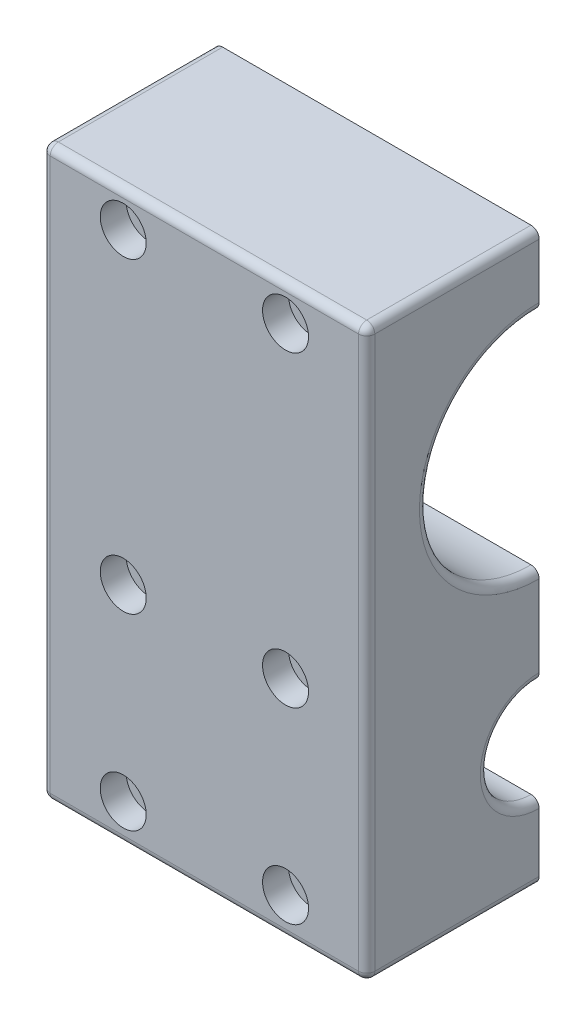
ISO-10303-21;
HEADER;
FILE_DESCRIPTION(('STEP AP214'),'2;1');
FILE_NAME('part.step','',(''),(''),'','','');
FILE_SCHEMA(('AUTOMOTIVE_DESIGN { 1 0 10303 214 1 1 1 1 }'));
ENDSEC;
DATA;
#1=APPLICATION_CONTEXT('core data for automotive mechanical design processes');
#2=APPLICATION_PROTOCOL_DEFINITION('international standard','automotive_design',2000,#1);
#3=PRODUCT_CONTEXT('',#1,'mechanical');
#4=PRODUCT('Part','Part','',(#3));
#5=PRODUCT_RELATED_PRODUCT_CATEGORY('part','',(#4));
#6=PRODUCT_DEFINITION_FORMATION('','',#4);
#7=PRODUCT_DEFINITION_CONTEXT('part definition',#1,'design');
#8=PRODUCT_DEFINITION('design','',#6,#7);
#9=PRODUCT_DEFINITION_SHAPE('','',#8);
#10=(LENGTH_UNIT() NAMED_UNIT(*) SI_UNIT(.MILLI.,.METRE.));
#11=(NAMED_UNIT(*) PLANE_ANGLE_UNIT() SI_UNIT($,.RADIAN.));
#12=(NAMED_UNIT(*) SI_UNIT($,.STERADIAN.) SOLID_ANGLE_UNIT());
#13=UNCERTAINTY_MEASURE_WITH_UNIT(LENGTH_MEASURE(1.E-05),#10,'distance_accuracy_value','');
#14=(GEOMETRIC_REPRESENTATION_CONTEXT(3) GLOBAL_UNCERTAINTY_ASSIGNED_CONTEXT((#13)) GLOBAL_UNIT_ASSIGNED_CONTEXT((#10,
#11,#12)) REPRESENTATION_CONTEXT('',''));
#15=CARTESIAN_POINT('',(0.,0.,0.));
#16=DIRECTION('',(0.,0.,1.));
#17=DIRECTION('',(1.,0.,0.));
#18=AXIS2_PLACEMENT_3D('',#15,#16,#17);
#19=CARTESIAN_POINT('',(0.,0.,-26.9875));
#20=DIRECTION('',(0.,0.,1.));
#21=DIRECTION('',(1.,0.,0.));
#22=AXIS2_PLACEMENT_3D('',#19,#20,#21);
#23=PLANE('',#22);
#24=DIRECTION('',(1.,0.,0.));
#25=VECTOR('',#24,1.);
#26=CARTESIAN_POINT('',(50.8,88.9,-26.9875));
#27=LINE('',#26,#25);
#28=CARTESIAN_POINT('',(1.27,88.9,-26.9875));
#29=VERTEX_POINT('',#28);
#30=CARTESIAN_POINT('',(49.53,88.9,-26.9875));
#31=VERTEX_POINT('',#30);
#32=EDGE_CURVE('E493',#29,#31,#27,.T.);
#33=ORIENTED_EDGE('',*,*,#32,.T.);
#34=CARTESIAN_POINT('',(49.53,87.63,-26.9875));
#35=DIRECTION('',(0.,0.,1.));
#36=DIRECTION('',(1.,0.,0.));
#37=AXIS2_PLACEMENT_3D('',#34,#35,#36);
#38=CIRCLE('',#37,1.27);
#39=CARTESIAN_POINT('',(50.8,87.63,-26.9875));
#40=VERTEX_POINT('',#39);
#41=EDGE_CURVE('E93',#31,#40,#38,.F.);
#42=ORIENTED_EDGE('',*,*,#41,.T.);
#43=DIRECTION('',(0.,-1.,0.));
#44=VECTOR('',#43,1.);
#45=CARTESIAN_POINT('',(50.8,0.,-26.9875));
#46=LINE('',#45,#44);
#47=CARTESIAN_POINT('',(50.8,79.0575,-26.9875));
#48=VERTEX_POINT('',#47);
#49=EDGE_CURVE('E86',#40,#48,#46,.T.);
#50=ORIENTED_EDGE('',*,*,#49,.T.);
#51=CARTESIAN_POINT('',(49.53,79.0575,-26.9875));
#52=DIRECTION('',(0.,0.,1.));
#53=DIRECTION('',(1.,0.,0.));
#54=AXIS2_PLACEMENT_3D('',#51,#52,#53);
#55=CIRCLE('',#54,1.27);
#56=CARTESIAN_POINT('',(49.53,77.7875,-26.9875));
#57=VERTEX_POINT('',#56);
#58=EDGE_CURVE('E216',#48,#57,#55,.F.);
#59=ORIENTED_EDGE('',*,*,#58,.T.);
#60=DIRECTION('',(-1.,0.,0.));
#61=VECTOR('',#60,1.);
#62=CARTESIAN_POINT('',(50.8,77.7875,-26.9875));
#63=LINE('',#62,#61);
#64=CARTESIAN_POINT('',(1.27,77.7875,-26.9875));
#65=VERTEX_POINT('',#64);
#66=EDGE_CURVE('E217',#57,#65,#63,.T.);
#67=ORIENTED_EDGE('',*,*,#66,.T.);
#68=CARTESIAN_POINT('',(1.27,79.0575,-26.9875));
#69=DIRECTION('',(0.,0.,1.));
#70=DIRECTION('',(1.,0.,0.));
#71=AXIS2_PLACEMENT_3D('',#68,#69,#70);
#72=CIRCLE('',#71,1.27);
#73=CARTESIAN_POINT('',(0.,79.0575,-26.9875));
#74=VERTEX_POINT('',#73);
#75=EDGE_CURVE('E79',#65,#74,#72,.F.);
#76=ORIENTED_EDGE('',*,*,#75,.T.);
#77=DIRECTION('',(0.,-1.,0.));
#78=VECTOR('',#77,1.);
#79=CARTESIAN_POINT('',(0.,0.,-26.9875));
#80=LINE('',#79,#78);
#81=CARTESIAN_POINT('',(0.,87.63,-26.9875));
#82=VERTEX_POINT('',#81);
#83=EDGE_CURVE('E209',#82,#74,#80,.T.);
#84=ORIENTED_EDGE('',*,*,#83,.F.);
#85=CARTESIAN_POINT('',(1.27,87.63,-26.9875));
#86=DIRECTION('',(0.,0.,1.));
#87=DIRECTION('',(1.,0.,0.));
#88=AXIS2_PLACEMENT_3D('',#85,#86,#87);
#89=CIRCLE('',#88,1.27);
#90=EDGE_CURVE('E496',#82,#29,#89,.F.);
#91=ORIENTED_EDGE('',*,*,#90,.T.);
#92=EDGE_LOOP('',(#33,#42,#50,#59,#67,#76,#84,#91));
#93=FACE_BOUND('',#92,.T.);
#94=CARTESIAN_POINT('',(38.1,83.34375,-26.9875));
#95=DIRECTION('',(0.,0.,1.));
#96=DIRECTION('',(1.,0.,0.));
#97=AXIS2_PLACEMENT_3D('',#94,#95,#96);
#98=CIRCLE('',#97,2.09);
#99=CARTESIAN_POINT('',(40.19,83.34375,-26.9875));
#100=VERTEX_POINT('',#99);
#101=EDGE_CURVE('E432',#100,#100,#98,.F.);
#102=ORIENTED_EDGE('',*,*,#101,.F.);
#103=EDGE_LOOP('',(#102));
#104=FACE_BOUND('',#103,.T.);
#105=CARTESIAN_POINT('',(12.7,83.34375,-26.9875));
#106=DIRECTION('',(0.,0.,1.));
#107=DIRECTION('',(1.,0.,0.));
#108=AXIS2_PLACEMENT_3D('',#105,#106,#107);
#109=CIRCLE('',#108,2.09);
#110=CARTESIAN_POINT('',(14.79,83.34375,-26.9875));
#111=VERTEX_POINT('',#110);
#112=EDGE_CURVE('E277',#111,#111,#109,.F.);
#113=ORIENTED_EDGE('',*,*,#112,.F.);
#114=EDGE_LOOP('',(#113));
#115=FACE_BOUND('',#114,.T.);
#116=ADVANCED_FACE('F70',(#93,#104,#115),#23,.F.);
#117=CARTESIAN_POINT('',(12.7,83.34375,-53.975));
#118=DIRECTION('',(0.,0.,1.));
#119=DIRECTION('',(1.,0.,0.));
#120=AXIS2_PLACEMENT_3D('',#117,#118,#119);
#121=CYLINDRICAL_SURFACE('',#120,2.09);
#122=ORIENTED_EDGE('',*,*,#112,.T.);
#123=EDGE_LOOP('',(#122));
#124=FACE_BOUND('',#123,.T.);
#125=CARTESIAN_POINT('',(12.7,83.34375,-4.064));
#126=DIRECTION('',(0.,0.,1.));
#127=DIRECTION('',(1.,0.,0.));
#128=AXIS2_PLACEMENT_3D('',#125,#126,#127);
#129=CIRCLE('',#128,2.09);
#130=CARTESIAN_POINT('',(14.79,83.34375,-4.064));
#131=VERTEX_POINT('',#130);
#132=EDGE_CURVE('E350',#131,#131,#129,.F.);
#133=ORIENTED_EDGE('',*,*,#132,.F.);
#134=EDGE_LOOP('',(#133));
#135=FACE_BOUND('',#134,.T.);
#136=ADVANCED_FACE('F617',(#124,#135),#121,.F.);
#137=CARTESIAN_POINT('',(38.1,5.87374999999999,-53.975));
#138=DIRECTION('',(0.,0.,1.));
#139=DIRECTION('',(1.,0.,0.));
#140=AXIS2_PLACEMENT_3D('',#137,#138,#139);
#141=CYLINDRICAL_SURFACE('',#140,2.09);
#142=CARTESIAN_POINT('',(38.1,5.87374999999999,-26.9875));
#143=DIRECTION('',(0.,0.,1.));
#144=DIRECTION('',(1.,0.,0.));
#145=AXIS2_PLACEMENT_3D('',#142,#143,#144);
#146=CIRCLE('',#145,2.09);
#147=CARTESIAN_POINT('',(40.19,5.87374999999999,-26.9875));
#148=VERTEX_POINT('',#147);
#149=EDGE_CURVE('E424',#148,#148,#146,.F.);
#150=ORIENTED_EDGE('',*,*,#149,.T.);
#151=EDGE_LOOP('',(#150));
#152=FACE_BOUND('',#151,.T.);
#153=CARTESIAN_POINT('',(38.1,5.87374999999999,-4.064));
#154=DIRECTION('',(0.,0.,1.));
#155=DIRECTION('',(1.,0.,0.));
#156=AXIS2_PLACEMENT_3D('',#153,#154,#155);
#157=CIRCLE('',#156,2.09);
#158=CARTESIAN_POINT('',(40.19,5.87374999999999,-4.064));
#159=VERTEX_POINT('',#158);
#160=EDGE_CURVE('E354',#159,#159,#157,.F.);
#161=ORIENTED_EDGE('',*,*,#160,.F.);
#162=EDGE_LOOP('',(#161));
#163=FACE_BOUND('',#162,.T.);
#164=ADVANCED_FACE('F622',(#152,#163),#141,.F.);
#165=CARTESIAN_POINT('',(12.7,35.2425,-53.975));
#166=DIRECTION('',(0.,0.,1.));
#167=DIRECTION('',(1.,0.,0.));
#168=AXIS2_PLACEMENT_3D('',#165,#166,#167);
#169=CYLINDRICAL_SURFACE('',#168,2.09);
#170=CARTESIAN_POINT('',(12.7,35.2425,-26.9875));
#171=DIRECTION('',(0.,0.,1.));
#172=DIRECTION('',(1.,0.,0.));
#173=AXIS2_PLACEMENT_3D('',#170,#171,#172);
#174=CIRCLE('',#173,2.09);
#175=CARTESIAN_POINT('',(14.79,35.2425,-26.9875));
#176=VERTEX_POINT('',#175);
#177=EDGE_CURVE('E428',#176,#176,#174,.F.);
#178=ORIENTED_EDGE('',*,*,#177,.T.);
#179=EDGE_LOOP('',(#178));
#180=FACE_BOUND('',#179,.T.);
#181=CARTESIAN_POINT('',(12.7,35.2425,-4.064));
#182=DIRECTION('',(0.,0.,1.));
#183=DIRECTION('',(1.,0.,0.));
#184=AXIS2_PLACEMENT_3D('',#181,#182,#183);
#185=CIRCLE('',#184,2.09);
#186=CARTESIAN_POINT('',(14.79,35.2425,-4.064));
#187=VERTEX_POINT('',#186);
#188=EDGE_CURVE('E358',#187,#187,#185,.F.);
#189=ORIENTED_EDGE('',*,*,#188,.F.);
#190=EDGE_LOOP('',(#189));
#191=FACE_BOUND('',#190,.T.);
#192=ADVANCED_FACE('F683',(#180,#191),#169,.F.);
#193=CARTESIAN_POINT('',(38.1,83.34375,-53.975));
#194=DIRECTION('',(0.,0.,1.));
#195=DIRECTION('',(1.,0.,0.));
#196=AXIS2_PLACEMENT_3D('',#193,#194,#195);
#197=CYLINDRICAL_SURFACE('',#196,2.09);
#198=ORIENTED_EDGE('',*,*,#101,.T.);
#199=EDGE_LOOP('',(#198));
#200=FACE_BOUND('',#199,.T.);
#201=CARTESIAN_POINT('',(38.1,83.34375,-4.064));
#202=DIRECTION('',(0.,0.,1.));
#203=DIRECTION('',(1.,0.,0.));
#204=AXIS2_PLACEMENT_3D('',#201,#202,#203);
#205=CIRCLE('',#204,2.09);
#206=CARTESIAN_POINT('',(40.19,83.34375,-4.064));
#207=VERTEX_POINT('',#206);
#208=EDGE_CURVE('E362',#207,#207,#205,.F.);
#209=ORIENTED_EDGE('',*,*,#208,.F.);
#210=EDGE_LOOP('',(#209));
#211=FACE_BOUND('',#210,.T.);
#212=ADVANCED_FACE('F679',(#200,#211),#197,.F.);
#213=CARTESIAN_POINT('',(38.1,35.2425,-53.975));
#214=DIRECTION('',(0.,0.,1.));
#215=DIRECTION('',(1.,0.,0.));
#216=AXIS2_PLACEMENT_3D('',#213,#214,#215);
#217=CYLINDRICAL_SURFACE('',#216,2.09);
#218=CARTESIAN_POINT('',(38.1,35.2425,-26.9875));
#219=DIRECTION('',(0.,0.,1.));
#220=DIRECTION('',(1.,0.,0.));
#221=AXIS2_PLACEMENT_3D('',#218,#219,#220);
#222=CIRCLE('',#221,2.09);
#223=CARTESIAN_POINT('',(40.19,35.2425,-26.9875));
#224=VERTEX_POINT('',#223);
#225=EDGE_CURVE('E436',#224,#224,#222,.F.);
#226=ORIENTED_EDGE('',*,*,#225,.T.);
#227=EDGE_LOOP('',(#226));
#228=FACE_BOUND('',#227,.T.);
#229=CARTESIAN_POINT('',(38.1,35.2425,-4.064));
#230=DIRECTION('',(0.,0.,1.));
#231=DIRECTION('',(1.,0.,0.));
#232=AXIS2_PLACEMENT_3D('',#229,#230,#231);
#233=CIRCLE('',#232,2.09);
#234=CARTESIAN_POINT('',(40.19,35.2425,-4.064));
#235=VERTEX_POINT('',#234);
#236=EDGE_CURVE('E366',#235,#235,#233,.F.);
#237=ORIENTED_EDGE('',*,*,#236,.F.);
#238=EDGE_LOOP('',(#237));
#239=FACE_BOUND('',#238,.T.);
#240=ADVANCED_FACE('F682',(#228,#239),#217,.F.);
#241=CARTESIAN_POINT('',(12.7,5.87374999999999,-53.975));
#242=DIRECTION('',(0.,0.,1.));
#243=DIRECTION('',(1.,0.,0.));
#244=AXIS2_PLACEMENT_3D('',#241,#242,#243);
#245=CYLINDRICAL_SURFACE('',#244,2.09);
#246=CARTESIAN_POINT('',(12.7,5.87374999999999,-26.9875));
#247=DIRECTION('',(0.,0.,1.));
#248=DIRECTION('',(1.,0.,0.));
#249=AXIS2_PLACEMENT_3D('',#246,#247,#248);
#250=CIRCLE('',#249,2.09);
#251=CARTESIAN_POINT('',(14.79,5.87374999999999,-26.9875));
#252=VERTEX_POINT('',#251);
#253=EDGE_CURVE('E440',#252,#252,#250,.F.);
#254=ORIENTED_EDGE('',*,*,#253,.T.);
#255=EDGE_LOOP('',(#254));
#256=FACE_BOUND('',#255,.T.);
#257=CARTESIAN_POINT('',(12.7,5.87374999999999,-4.064));
#258=DIRECTION('',(0.,0.,1.));
#259=DIRECTION('',(1.,0.,0.));
#260=AXIS2_PLACEMENT_3D('',#257,#258,#259);
#261=CIRCLE('',#260,2.09);
#262=CARTESIAN_POINT('',(14.79,5.87374999999999,-4.064));
#263=VERTEX_POINT('',#262);
#264=EDGE_CURVE('E370',#263,#263,#261,.F.);
#265=ORIENTED_EDGE('',*,*,#264,.F.);
#266=EDGE_LOOP('',(#265));
#267=FACE_BOUND('',#266,.T.);
#268=ADVANCED_FACE('F673',(#256,#267),#245,.F.);
#269=CARTESIAN_POINT('',(50.8,0.,0.));
#270=DIRECTION('',(1.,0.,0.));
#271=DIRECTION('',(0.,0.,-1.));
#272=AXIS2_PLACEMENT_3D('',#269,#270,#271);
#273=PLANE('',#272);
#274=ORIENTED_EDGE('',*,*,#49,.F.);
#275=DIRECTION('',(0.,0.,-1.));
#276=VECTOR('',#275,1.);
#277=CARTESIAN_POINT('',(50.8,87.63,0.));
#278=LINE('',#277,#276);
#279=CARTESIAN_POINT('',(50.8,87.63,-1.26999999999999));
#280=VERTEX_POINT('',#279);
#281=EDGE_CURVE('E305',#40,#280,#278,.F.);
#282=ORIENTED_EDGE('',*,*,#281,.T.);
#283=DIRECTION('',(0.,1.,0.));
#284=VECTOR('',#283,1.);
#285=CARTESIAN_POINT('',(50.8,0.,-1.27));
#286=LINE('',#285,#284);
#287=CARTESIAN_POINT('',(50.8,1.27,-1.27));
#288=VERTEX_POINT('',#287);
#289=EDGE_CURVE('E302',#280,#288,#286,.F.);
#290=ORIENTED_EDGE('',*,*,#289,.T.);
#291=DIRECTION('',(0.,0.,-1.));
#292=VECTOR('',#291,1.);
#293=CARTESIAN_POINT('',(50.8,1.27,-53.975));
#294=LINE('',#293,#292);
#295=CARTESIAN_POINT('',(50.8,1.27,-26.9875));
#296=VERTEX_POINT('',#295);
#297=EDGE_CURVE('E298',#288,#296,#294,.T.);
#298=ORIENTED_EDGE('',*,*,#297,.T.);
#299=CARTESIAN_POINT('',(50.8,10.4775,-26.9875));
#300=VERTEX_POINT('',#299);
#301=EDGE_CURVE('E459',#300,#296,#46,.T.);
#302=ORIENTED_EDGE('',*,*,#301,.F.);
#303=CARTESIAN_POINT('',(50.8,19.685,-26.9875));
#304=DIRECTION('',(1.,0.,0.));
#305=DIRECTION('',(0.,0.,-1.));
#306=AXIS2_PLACEMENT_3D('',#303,#304,#305);
#307=CIRCLE('',#306,9.20750000000001);
#308=CARTESIAN_POINT('',(50.8,28.8925,-26.9875));
#309=VERTEX_POINT('',#308);
#310=EDGE_CURVE('E291',#300,#309,#307,.F.);
#311=ORIENTED_EDGE('',*,*,#310,.T.);
#312=CARTESIAN_POINT('',(50.8,41.5925,-26.9875));
#313=VERTEX_POINT('',#312);
#314=EDGE_CURVE('E472',#313,#309,#46,.T.);
#315=ORIENTED_EDGE('',*,*,#314,.F.);
#316=CARTESIAN_POINT('',(50.8,60.325,-26.9875));
#317=DIRECTION('',(1.,0.,0.));
#318=DIRECTION('',(0.,0.,-1.));
#319=AXIS2_PLACEMENT_3D('',#316,#317,#318);
#320=CIRCLE('',#319,18.7325);
#321=EDGE_CURVE('E295',#313,#48,#320,.F.);
#322=ORIENTED_EDGE('',*,*,#321,.T.);
#323=EDGE_LOOP('',(#274,#282,#290,#298,#302,#311,#315,#322));
#324=FACE_BOUND('',#323,.T.);
#325=ADVANCED_FACE('F562',(#324),#273,.T.);
#326=CARTESIAN_POINT('',(0.,0.,0.));
#327=DIRECTION('',(1.,0.,0.));
#328=DIRECTION('',(0.,0.,-1.));
#329=AXIS2_PLACEMENT_3D('',#326,#327,#328);
#330=PLANE('',#329);
#331=DIRECTION('',(0.,0.,-1.));
#332=VECTOR('',#331,1.);
#333=CARTESIAN_POINT('',(0.,87.63,-53.975));
#334=LINE('',#333,#332);
#335=CARTESIAN_POINT('',(0.,87.63,-1.26999999999999));
#336=VERTEX_POINT('',#335);
#337=EDGE_CURVE('E212',#336,#82,#334,.T.);
#338=ORIENTED_EDGE('',*,*,#337,.T.);
#339=ORIENTED_EDGE('',*,*,#83,.T.);
#340=CARTESIAN_POINT('',(0.,60.325,-26.9875));
#341=DIRECTION('',(1.,0.,0.));
#342=DIRECTION('',(0.,0.,-1.));
#343=AXIS2_PLACEMENT_3D('',#340,#341,#342);
#344=CIRCLE('',#343,18.7325);
#345=CARTESIAN_POINT('',(0.,41.5925,-26.9875));
#346=VERTEX_POINT('',#345);
#347=EDGE_CURVE('E197',#74,#346,#344,.T.);
#348=ORIENTED_EDGE('',*,*,#347,.T.);
#349=CARTESIAN_POINT('',(0.,28.8925,-26.9875));
#350=VERTEX_POINT('',#349);
#351=EDGE_CURVE('E220',#346,#350,#80,.T.);
#352=ORIENTED_EDGE('',*,*,#351,.T.);
#353=CARTESIAN_POINT('',(0.,19.685,-26.9875));
#354=DIRECTION('',(1.,0.,0.));
#355=DIRECTION('',(0.,0.,-1.));
#356=AXIS2_PLACEMENT_3D('',#353,#354,#355);
#357=CIRCLE('',#356,9.20750000000001);
#358=CARTESIAN_POINT('',(0.,10.4775,-26.9875));
#359=VERTEX_POINT('',#358);
#360=EDGE_CURVE('E204',#350,#359,#357,.T.);
#361=ORIENTED_EDGE('',*,*,#360,.T.);
#362=CARTESIAN_POINT('',(0.,1.27,-26.9875));
#363=VERTEX_POINT('',#362);
#364=EDGE_CURVE('E219',#359,#363,#80,.T.);
#365=ORIENTED_EDGE('',*,*,#364,.T.);
#366=DIRECTION('',(0.,0.,-1.));
#367=VECTOR('',#366,1.);
#368=CARTESIAN_POINT('',(0.,1.27,0.));
#369=LINE('',#368,#367);
#370=CARTESIAN_POINT('',(0.,1.27,-1.27));
#371=VERTEX_POINT('',#370);
#372=EDGE_CURVE('E205',#363,#371,#369,.F.);
#373=ORIENTED_EDGE('',*,*,#372,.T.);
#374=DIRECTION('',(0.,1.,0.));
#375=VECTOR('',#374,1.);
#376=CARTESIAN_POINT('',(0.,88.9,-1.26999999999999));
#377=LINE('',#376,#375);
#378=EDGE_CURVE('E321',#371,#336,#377,.T.);
#379=ORIENTED_EDGE('',*,*,#378,.T.);
#380=EDGE_LOOP('',(#338,#339,#348,#352,#361,#365,#373,#379));
#381=FACE_BOUND('',#380,.T.);
#382=ADVANCED_FACE('F210',(#381),#330,.F.);
#383=CARTESIAN_POINT('',(50.8,0.,0.));
#384=DIRECTION('',(0.,1.,0.));
#385=DIRECTION('',(0.,0.,1.));
#386=AXIS2_PLACEMENT_3D('',#383,#384,#385);
#387=PLANE('',#386);
#388=DIRECTION('',(0.,0.,-1.));
#389=VECTOR('',#388,1.);
#390=CARTESIAN_POINT('',(1.27,0.,0.));
#391=LINE('',#390,#389);
#392=CARTESIAN_POINT('',(1.27,0.,-1.27));
#393=VERTEX_POINT('',#392);
#394=CARTESIAN_POINT('',(1.27,0.,-26.9875));
#395=VERTEX_POINT('',#394);
#396=EDGE_CURVE('E339',#393,#395,#391,.T.);
#397=ORIENTED_EDGE('',*,*,#396,.T.);
#398=DIRECTION('',(1.,0.,0.));
#399=VECTOR('',#398,1.);
#400=CARTESIAN_POINT('',(50.8,0.,-26.9875));
#401=LINE('',#400,#399);
#402=CARTESIAN_POINT('',(49.53,0.,-26.9875));
#403=VERTEX_POINT('',#402);
#404=EDGE_CURVE('E448',#395,#403,#401,.T.);
#405=ORIENTED_EDGE('',*,*,#404,.T.);
#406=DIRECTION('',(0.,0.,-1.));
#407=VECTOR('',#406,1.);
#408=CARTESIAN_POINT('',(49.53,0.,0.));
#409=LINE('',#408,#407);
#410=CARTESIAN_POINT('',(49.53,0.,-1.27));
#411=VERTEX_POINT('',#410);
#412=EDGE_CURVE('E347',#403,#411,#409,.F.);
#413=ORIENTED_EDGE('',*,*,#412,.T.);
#414=DIRECTION('',(-1.,0.,0.));
#415=VECTOR('',#414,1.);
#416=CARTESIAN_POINT('',(0.,0.,-1.27));
#417=LINE('',#416,#415);
#418=EDGE_CURVE('E343',#411,#393,#417,.T.);
#419=ORIENTED_EDGE('',*,*,#418,.T.);
#420=EDGE_LOOP('',(#397,#405,#413,#419));
#421=FACE_BOUND('',#420,.T.);
#422=ADVANCED_FACE('F522',(#421),#387,.F.);
#423=CARTESIAN_POINT('',(50.8,88.9,0.));
#424=DIRECTION('',(0.,1.,0.));
#425=DIRECTION('',(0.,0.,1.));
#426=AXIS2_PLACEMENT_3D('',#423,#424,#425);
#427=PLANE('',#426);
#428=ORIENTED_EDGE('',*,*,#32,.F.);
#429=DIRECTION('',(0.,0.,-1.));
#430=VECTOR('',#429,1.);
#431=CARTESIAN_POINT('',(1.27,88.9,0.));
#432=LINE('',#431,#430);
#433=CARTESIAN_POINT('',(1.27,88.9,-1.26999999999999));
#434=VERTEX_POINT('',#433);
#435=EDGE_CURVE('E229',#29,#434,#432,.F.);
#436=ORIENTED_EDGE('',*,*,#435,.T.);
#437=DIRECTION('',(-1.,0.,0.));
#438=VECTOR('',#437,1.);
#439=CARTESIAN_POINT('',(50.8,88.9,-1.26999999999999));
#440=LINE('',#439,#438);
#441=CARTESIAN_POINT('',(49.53,88.9,-1.26999999999999));
#442=VERTEX_POINT('',#441);
#443=EDGE_CURVE('E226',#434,#442,#440,.F.);
#444=ORIENTED_EDGE('',*,*,#443,.T.);
#445=DIRECTION('',(0.,0.,-1.));
#446=VECTOR('',#445,1.);
#447=CARTESIAN_POINT('',(49.53,88.9,0.));
#448=LINE('',#447,#446);
#449=EDGE_CURVE('E281',#442,#31,#448,.T.);
#450=ORIENTED_EDGE('',*,*,#449,.T.);
#451=EDGE_LOOP('',(#428,#436,#444,#450));
#452=FACE_BOUND('',#451,.T.);
#453=ADVANCED_FACE('F557',(#452),#427,.T.);
#454=CARTESIAN_POINT('',(50.8,0.,0.));
#455=DIRECTION('',(0.,0.,1.));
#456=DIRECTION('',(0.,-1.,0.));
#457=AXIS2_PLACEMENT_3D('',#454,#455,#456);
#458=PLANE('',#457);
#459=DIRECTION('',(0.,1.,0.));
#460=VECTOR('',#459,1.);
#461=CARTESIAN_POINT('',(1.27,0.,0.));
#462=LINE('',#461,#460);
#463=CARTESIAN_POINT('',(1.27,87.63,0.));
#464=VERTEX_POINT('',#463);
#465=CARTESIAN_POINT('',(1.27,1.27,0.));
#466=VERTEX_POINT('',#465);
#467=EDGE_CURVE('E333',#464,#466,#462,.F.);
#468=ORIENTED_EDGE('',*,*,#467,.T.);
#469=DIRECTION('',(-1.,0.,0.));
#470=VECTOR('',#469,1.);
#471=CARTESIAN_POINT('',(50.8,1.27,0.));
#472=LINE('',#471,#470);
#473=CARTESIAN_POINT('',(49.53,1.27,0.));
#474=VERTEX_POINT('',#473);
#475=EDGE_CURVE('E326',#466,#474,#472,.F.);
#476=ORIENTED_EDGE('',*,*,#475,.T.);
#477=DIRECTION('',(0.,1.,0.));
#478=VECTOR('',#477,1.);
#479=CARTESIAN_POINT('',(49.53,0.,0.));
#480=LINE('',#479,#478);
#481=CARTESIAN_POINT('',(49.53,87.63,0.));
#482=VERTEX_POINT('',#481);
#483=EDGE_CURVE('E330',#474,#482,#480,.T.);
#484=ORIENTED_EDGE('',*,*,#483,.T.);
#485=DIRECTION('',(-1.,0.,0.));
#486=VECTOR('',#485,1.);
#487=CARTESIAN_POINT('',(50.8,87.63,0.));
#488=LINE('',#487,#486);
#489=EDGE_CURVE('E336',#482,#464,#488,.T.);
#490=ORIENTED_EDGE('',*,*,#489,.T.);
#491=EDGE_LOOP('',(#468,#476,#484,#490));
#492=FACE_BOUND('',#491,.T.);
#493=CARTESIAN_POINT('',(38.1,83.34375,0.));
#494=DIRECTION('',(0.,0.,1.));
#495=DIRECTION('',(1.,0.,0.));
#496=AXIS2_PLACEMENT_3D('',#493,#494,#495);
#497=CIRCLE('',#496,3.6);
#498=CARTESIAN_POINT('',(41.7,83.34375,0.));
#499=VERTEX_POINT('',#498);
#500=EDGE_CURVE('E379',#499,#499,#497,.T.);
#501=ORIENTED_EDGE('',*,*,#500,.F.);
#502=EDGE_LOOP('',(#501));
#503=FACE_BOUND('',#502,.T.);
#504=CARTESIAN_POINT('',(38.1,35.2425,0.));
#505=DIRECTION('',(0.,0.,1.));
#506=DIRECTION('',(1.,0.,0.));
#507=AXIS2_PLACEMENT_3D('',#504,#505,#506);
#508=CIRCLE('',#507,3.6);
#509=CARTESIAN_POINT('',(41.7,35.2425,0.));
#510=VERTEX_POINT('',#509);
#511=EDGE_CURVE('E404',#510,#510,#508,.T.);
#512=ORIENTED_EDGE('',*,*,#511,.F.);
#513=EDGE_LOOP('',(#512));
#514=FACE_BOUND('',#513,.T.);
#515=CARTESIAN_POINT('',(12.7,35.2425,0.));
#516=DIRECTION('',(0.,0.,1.));
#517=DIRECTION('',(1.,0.,0.));
#518=AXIS2_PLACEMENT_3D('',#515,#516,#517);
#519=CIRCLE('',#518,3.6);
#520=CARTESIAN_POINT('',(16.3,35.2425,0.));
#521=VERTEX_POINT('',#520);
#522=EDGE_CURVE('E396',#521,#521,#519,.T.);
#523=ORIENTED_EDGE('',*,*,#522,.F.);
#524=EDGE_LOOP('',(#523));
#525=FACE_BOUND('',#524,.T.);
#526=CARTESIAN_POINT('',(12.7,5.87374999999999,0.));
#527=DIRECTION('',(0.,0.,1.));
#528=DIRECTION('',(1.,0.,0.));
#529=AXIS2_PLACEMENT_3D('',#526,#527,#528);
#530=CIRCLE('',#529,3.6);
#531=CARTESIAN_POINT('',(16.3,5.87374999999999,0.));
#532=VERTEX_POINT('',#531);
#533=EDGE_CURVE('E387',#532,#532,#530,.T.);
#534=ORIENTED_EDGE('',*,*,#533,.F.);
#535=EDGE_LOOP('',(#534));
#536=FACE_BOUND('',#535,.T.);
#537=CARTESIAN_POINT('',(38.1,5.87374999999999,0.));
#538=DIRECTION('',(0.,0.,1.));
#539=DIRECTION('',(1.,0.,0.));
#540=AXIS2_PLACEMENT_3D('',#537,#538,#539);
#541=CIRCLE('',#540,3.6);
#542=CARTESIAN_POINT('',(41.7,5.87374999999999,0.));
#543=VERTEX_POINT('',#542);
#544=EDGE_CURVE('E388',#543,#543,#541,.T.);
#545=ORIENTED_EDGE('',*,*,#544,.F.);
#546=EDGE_LOOP('',(#545));
#547=FACE_BOUND('',#546,.T.);
#548=CARTESIAN_POINT('',(12.7,83.34375,0.));
#549=DIRECTION('',(0.,0.,1.));
#550=DIRECTION('',(1.,0.,0.));
#551=AXIS2_PLACEMENT_3D('',#548,#549,#550);
#552=CIRCLE('',#551,3.6);
#553=CARTESIAN_POINT('',(16.3,83.34375,0.));
#554=VERTEX_POINT('',#553);
#555=EDGE_CURVE('E375',#554,#554,#552,.T.);
#556=ORIENTED_EDGE('',*,*,#555,.F.);
#557=EDGE_LOOP('',(#556));
#558=FACE_BOUND('',#557,.T.);
#559=ADVANCED_FACE('F584',(#492,#503,#514,#525,#536,#547,#558),#458,.T.);
#560=CARTESIAN_POINT('',(50.8,60.325,-26.9875));
#561=DIRECTION('',(-1.,0.,0.));
#562=DIRECTION('',(0.,0.,1.));
#563=AXIS2_PLACEMENT_3D('',#560,#561,#562);
#564=CYLINDRICAL_SURFACE('',#563,17.4625);
#565=ORIENTED_EDGE('',*,*,#66,.F.);
#566=CARTESIAN_POINT('',(49.53,60.325,-26.9875));
#567=DIRECTION('',(1.,0.,0.));
#568=DIRECTION('',(0.,0.,-1.));
#569=AXIS2_PLACEMENT_3D('',#566,#567,#568);
#570=CIRCLE('',#569,17.4625);
#571=CARTESIAN_POINT('',(49.53,42.8625,-26.9875));
#572=VERTEX_POINT('',#571);
#573=EDGE_CURVE('E284',#57,#572,#570,.T.);
#574=ORIENTED_EDGE('',*,*,#573,.T.);
#575=DIRECTION('',(-1.,0.,0.));
#576=VECTOR('',#575,1.);
#577=CARTESIAN_POINT('',(50.8,42.8625,-26.9875));
#578=LINE('',#577,#576);
#579=CARTESIAN_POINT('',(1.27,42.8625,-26.9875));
#580=VERTEX_POINT('',#579);
#581=EDGE_CURVE('E485',#580,#572,#578,.F.);
#582=ORIENTED_EDGE('',*,*,#581,.F.);
#583=CARTESIAN_POINT('',(1.27,60.325,-26.9875));
#584=DIRECTION('',(1.,0.,0.));
#585=DIRECTION('',(0.,0.,-1.));
#586=AXIS2_PLACEMENT_3D('',#583,#584,#585);
#587=CIRCLE('',#586,17.4625);
#588=EDGE_CURVE('E288',#580,#65,#587,.F.);
#589=ORIENTED_EDGE('',*,*,#588,.T.);
#590=EDGE_LOOP('',(#565,#574,#582,#589));
#591=FACE_BOUND('',#590,.T.);
#592=ADVANCED_FACE('F569',(#591),#564,.F.);
#593=CARTESIAN_POINT('',(50.8,19.685,-26.9875));
#594=DIRECTION('',(-1.,0.,0.));
#595=DIRECTION('',(0.,0.,1.));
#596=AXIS2_PLACEMENT_3D('',#593,#594,#595);
#597=CYLINDRICAL_SURFACE('',#596,7.93750000000001);
#598=DIRECTION('',(-1.,0.,0.));
#599=VECTOR('',#598,1.);
#600=CARTESIAN_POINT('',(50.8,27.6225,-26.9875));
#601=LINE('',#600,#599);
#602=CARTESIAN_POINT('',(49.53,27.6225,-26.9875));
#603=VERTEX_POINT('',#602);
#604=CARTESIAN_POINT('',(1.27,27.6225,-26.9875));
#605=VERTEX_POINT('',#604);
#606=EDGE_CURVE('E473',#603,#605,#601,.T.);
#607=ORIENTED_EDGE('',*,*,#606,.F.);
#608=CARTESIAN_POINT('',(49.53,19.685,-26.9875));
#609=DIRECTION('',(1.,0.,0.));
#610=DIRECTION('',(0.,0.,-1.));
#611=AXIS2_PLACEMENT_3D('',#608,#609,#610);
#612=CIRCLE('',#611,7.93750000000001);
#613=CARTESIAN_POINT('',(49.53,11.7475,-26.9875));
#614=VERTEX_POINT('',#613);
#615=EDGE_CURVE('E312',#603,#614,#612,.T.);
#616=ORIENTED_EDGE('',*,*,#615,.T.);
#617=DIRECTION('',(-1.,0.,0.));
#618=VECTOR('',#617,1.);
#619=CARTESIAN_POINT('',(50.8,11.7475,-26.9875));
#620=LINE('',#619,#618);
#621=CARTESIAN_POINT('',(1.27,11.7475,-26.9875));
#622=VERTEX_POINT('',#621);
#623=EDGE_CURVE('E460',#622,#614,#620,.F.);
#624=ORIENTED_EDGE('',*,*,#623,.F.);
#625=CARTESIAN_POINT('',(1.27,19.685,-26.9875));
#626=DIRECTION('',(1.,0.,0.));
#627=DIRECTION('',(0.,0.,-1.));
#628=AXIS2_PLACEMENT_3D('',#625,#626,#627);
#629=CIRCLE('',#628,7.93750000000001);
#630=EDGE_CURVE('E308',#622,#605,#629,.F.);
#631=ORIENTED_EDGE('',*,*,#630,.T.);
#632=EDGE_LOOP('',(#607,#616,#624,#631));
#633=FACE_BOUND('',#632,.T.);
#634=ADVANCED_FACE('F574',(#633),#597,.F.);
#635=CARTESIAN_POINT('',(12.7,5.87374999999999,-4.064));
#636=DIRECTION('',(0.,0.,1.));
#637=DIRECTION('',(1.,0.,0.));
#638=AXIS2_PLACEMENT_3D('',#635,#636,#637);
#639=PLANE('',#638);
#640=CARTESIAN_POINT('',(12.7,5.87374999999999,-4.064));
#641=DIRECTION('',(0.,0.,1.));
#642=DIRECTION('',(1.,0.,0.));
#643=AXIS2_PLACEMENT_3D('',#640,#641,#642);
#644=CIRCLE('',#643,3.6);
#645=CARTESIAN_POINT('',(16.3,5.87374999999999,-4.064));
#646=VERTEX_POINT('',#645);
#647=EDGE_CURVE('E383',#646,#646,#644,.T.);
#648=ORIENTED_EDGE('',*,*,#647,.T.);
#649=EDGE_LOOP('',(#648));
#650=FACE_BOUND('',#649,.T.);
#651=ORIENTED_EDGE('',*,*,#264,.T.);
#652=EDGE_LOOP('',(#651));
#653=FACE_BOUND('',#652,.T.);
#654=ADVANCED_FACE('F677',(#650,#653),#639,.T.);
#655=CARTESIAN_POINT('',(12.7,5.87374999999999,-4.064));
#656=DIRECTION('',(0.,0.,1.));
#657=DIRECTION('',(1.,0.,0.));
#658=AXIS2_PLACEMENT_3D('',#655,#656,#657);
#659=CYLINDRICAL_SURFACE('',#658,3.6);
#660=ORIENTED_EDGE('',*,*,#647,.F.);
#661=EDGE_LOOP('',(#660));
#662=FACE_BOUND('',#661,.T.);
#663=ORIENTED_EDGE('',*,*,#533,.T.);
#664=EDGE_LOOP('',(#663));
#665=FACE_BOUND('',#664,.T.);
#666=ADVANCED_FACE('F729',(#662,#665),#659,.F.);
#667=CARTESIAN_POINT('',(38.1,35.2425,-4.064));
#668=DIRECTION('',(0.,0.,1.));
#669=DIRECTION('',(1.,0.,0.));
#670=AXIS2_PLACEMENT_3D('',#667,#668,#669);
#671=PLANE('',#670);
#672=CARTESIAN_POINT('',(38.1,35.2425,-4.064));
#673=DIRECTION('',(0.,0.,1.));
#674=DIRECTION('',(1.,0.,0.));
#675=AXIS2_PLACEMENT_3D('',#672,#673,#674);
#676=CIRCLE('',#675,3.6);
#677=CARTESIAN_POINT('',(41.7,35.2425,-4.064));
#678=VERTEX_POINT('',#677);
#679=EDGE_CURVE('E400',#678,#678,#676,.T.);
#680=ORIENTED_EDGE('',*,*,#679,.T.);
#681=EDGE_LOOP('',(#680));
#682=FACE_BOUND('',#681,.T.);
#683=ORIENTED_EDGE('',*,*,#236,.T.);
#684=EDGE_LOOP('',(#683));
#685=FACE_BOUND('',#684,.T.);
#686=ADVANCED_FACE('F726',(#682,#685),#671,.T.);
#687=CARTESIAN_POINT('',(38.1,35.2425,-4.064));
#688=DIRECTION('',(0.,0.,1.));
#689=DIRECTION('',(1.,0.,0.));
#690=AXIS2_PLACEMENT_3D('',#687,#688,#689);
#691=CYLINDRICAL_SURFACE('',#690,3.6);
#692=ORIENTED_EDGE('',*,*,#679,.F.);
#693=EDGE_LOOP('',(#692));
#694=FACE_BOUND('',#693,.T.);
#695=ORIENTED_EDGE('',*,*,#511,.T.);
#696=EDGE_LOOP('',(#695));
#697=FACE_BOUND('',#696,.T.);
#698=ADVANCED_FACE('F722',(#694,#697),#691,.F.);
#699=CARTESIAN_POINT('',(38.1,83.34375,-4.064));
#700=DIRECTION('',(0.,0.,1.));
#701=DIRECTION('',(1.,0.,0.));
#702=AXIS2_PLACEMENT_3D('',#699,#700,#701);
#703=PLANE('',#702);
#704=CARTESIAN_POINT('',(38.1,83.34375,-4.064));
#705=DIRECTION('',(0.,0.,1.));
#706=DIRECTION('',(1.,0.,0.));
#707=AXIS2_PLACEMENT_3D('',#704,#705,#706);
#708=CIRCLE('',#707,3.6);
#709=CARTESIAN_POINT('',(41.7,83.34375,-4.064));
#710=VERTEX_POINT('',#709);
#711=EDGE_CURVE('E408',#710,#710,#708,.T.);
#712=ORIENTED_EDGE('',*,*,#711,.T.);
#713=EDGE_LOOP('',(#712));
#714=FACE_BOUND('',#713,.T.);
#715=ORIENTED_EDGE('',*,*,#208,.T.);
#716=EDGE_LOOP('',(#715));
#717=FACE_BOUND('',#716,.T.);
#718=ADVANCED_FACE('F718',(#714,#717),#703,.T.);
#719=CARTESIAN_POINT('',(38.1,83.34375,-4.064));
#720=DIRECTION('',(0.,0.,1.));
#721=DIRECTION('',(1.,0.,0.));
#722=AXIS2_PLACEMENT_3D('',#719,#720,#721);
#723=CYLINDRICAL_SURFACE('',#722,3.6);
#724=ORIENTED_EDGE('',*,*,#711,.F.);
#725=EDGE_LOOP('',(#724));
#726=FACE_BOUND('',#725,.T.);
#727=ORIENTED_EDGE('',*,*,#500,.T.);
#728=EDGE_LOOP('',(#727));
#729=FACE_BOUND('',#728,.T.);
#730=ADVANCED_FACE('F715',(#726,#729),#723,.F.);
#731=CARTESIAN_POINT('',(12.7,35.2425,-4.064));
#732=DIRECTION('',(0.,0.,1.));
#733=DIRECTION('',(1.,0.,0.));
#734=AXIS2_PLACEMENT_3D('',#731,#732,#733);
#735=PLANE('',#734);
#736=CARTESIAN_POINT('',(12.7,35.2425,-4.064));
#737=DIRECTION('',(0.,0.,1.));
#738=DIRECTION('',(1.,0.,0.));
#739=AXIS2_PLACEMENT_3D('',#736,#737,#738);
#740=CIRCLE('',#739,3.6);
#741=CARTESIAN_POINT('',(16.3,35.2425,-4.064));
#742=VERTEX_POINT('',#741);
#743=EDGE_CURVE('E392',#742,#742,#740,.T.);
#744=ORIENTED_EDGE('',*,*,#743,.T.);
#745=EDGE_LOOP('',(#744));
#746=FACE_BOUND('',#745,.T.);
#747=ORIENTED_EDGE('',*,*,#188,.T.);
#748=EDGE_LOOP('',(#747));
#749=FACE_BOUND('',#748,.T.);
#750=ADVANCED_FACE('F711',(#746,#749),#735,.T.);
#751=CARTESIAN_POINT('',(12.7,35.2425,-4.064));
#752=DIRECTION('',(0.,0.,1.));
#753=DIRECTION('',(1.,0.,0.));
#754=AXIS2_PLACEMENT_3D('',#751,#752,#753);
#755=CYLINDRICAL_SURFACE('',#754,3.6);
#756=ORIENTED_EDGE('',*,*,#743,.F.);
#757=EDGE_LOOP('',(#756));
#758=FACE_BOUND('',#757,.T.);
#759=ORIENTED_EDGE('',*,*,#522,.T.);
#760=EDGE_LOOP('',(#759));
#761=FACE_BOUND('',#760,.T.);
#762=ADVANCED_FACE('F703',(#758,#761),#755,.F.);
#763=CARTESIAN_POINT('',(38.1,5.87374999999999,-4.064));
#764=DIRECTION('',(0.,0.,1.));
#765=DIRECTION('',(1.,0.,0.));
#766=AXIS2_PLACEMENT_3D('',#763,#764,#765);
#767=PLANE('',#766);
#768=CARTESIAN_POINT('',(38.1,5.87374999999999,-4.064));
#769=DIRECTION('',(0.,0.,1.));
#770=DIRECTION('',(1.,0.,0.));
#771=AXIS2_PLACEMENT_3D('',#768,#769,#770);
#772=CIRCLE('',#771,3.6);
#773=CARTESIAN_POINT('',(41.7,5.87374999999999,-4.064));
#774=VERTEX_POINT('',#773);
#775=EDGE_CURVE('E236',#774,#774,#772,.T.);
#776=ORIENTED_EDGE('',*,*,#775,.T.);
#777=EDGE_LOOP('',(#776));
#778=FACE_BOUND('',#777,.T.);
#779=ORIENTED_EDGE('',*,*,#160,.T.);
#780=EDGE_LOOP('',(#779));
#781=FACE_BOUND('',#780,.T.);
#782=ADVANCED_FACE('F701',(#778,#781),#767,.T.);
#783=CARTESIAN_POINT('',(38.1,5.87374999999999,-4.064));
#784=DIRECTION('',(0.,0.,1.));
#785=DIRECTION('',(1.,0.,0.));
#786=AXIS2_PLACEMENT_3D('',#783,#784,#785);
#787=CYLINDRICAL_SURFACE('',#786,3.6);
#788=ORIENTED_EDGE('',*,*,#775,.F.);
#789=EDGE_LOOP('',(#788));
#790=FACE_BOUND('',#789,.T.);
#791=ORIENTED_EDGE('',*,*,#544,.T.);
#792=EDGE_LOOP('',(#791));
#793=FACE_BOUND('',#792,.T.);
#794=ADVANCED_FACE('F611',(#790,#793),#787,.F.);
#795=CARTESIAN_POINT('',(12.7,83.34375,-4.064));
#796=DIRECTION('',(0.,0.,1.));
#797=DIRECTION('',(1.,0.,0.));
#798=AXIS2_PLACEMENT_3D('',#795,#796,#797);
#799=PLANE('',#798);
#800=CARTESIAN_POINT('',(12.7,83.34375,-4.064));
#801=DIRECTION('',(0.,0.,1.));
#802=DIRECTION('',(1.,0.,0.));
#803=AXIS2_PLACEMENT_3D('',#800,#801,#802);
#804=CIRCLE('',#803,3.6);
#805=CARTESIAN_POINT('',(16.3,83.34375,-4.064));
#806=VERTEX_POINT('',#805);
#807=EDGE_CURVE('E374',#806,#806,#804,.T.);
#808=ORIENTED_EDGE('',*,*,#807,.T.);
#809=EDGE_LOOP('',(#808));
#810=FACE_BOUND('',#809,.T.);
#811=ORIENTED_EDGE('',*,*,#132,.T.);
#812=EDGE_LOOP('',(#811));
#813=FACE_BOUND('',#812,.T.);
#814=ADVANCED_FACE('F603',(#810,#813),#799,.T.);
#815=CARTESIAN_POINT('',(12.7,83.34375,-4.064));
#816=DIRECTION('',(0.,0.,1.));
#817=DIRECTION('',(1.,0.,0.));
#818=AXIS2_PLACEMENT_3D('',#815,#816,#817);
#819=CYLINDRICAL_SURFACE('',#818,3.6);
#820=ORIENTED_EDGE('',*,*,#807,.F.);
#821=EDGE_LOOP('',(#820));
#822=FACE_BOUND('',#821,.T.);
#823=ORIENTED_EDGE('',*,*,#555,.T.);
#824=EDGE_LOOP('',(#823));
#825=FACE_BOUND('',#824,.T.);
#826=ADVANCED_FACE('F600',(#822,#825),#819,.F.);
#827=CARTESIAN_POINT('',(49.53,87.63,0.));
#828=DIRECTION('',(0.,0.,-1.));
#829=DIRECTION('',(-1.,0.,0.));
#830=AXIS2_PLACEMENT_3D('',#827,#828,#829);
#831=CYLINDRICAL_SURFACE('',#830,1.27);
#832=ORIENTED_EDGE('',*,*,#41,.F.);
#833=ORIENTED_EDGE('',*,*,#449,.F.);
#834=CARTESIAN_POINT('',(49.53,87.63,-1.26999999999999));
#835=DIRECTION('',(0.,0.,1.));
#836=DIRECTION('',(1.,0.,0.));
#837=AXIS2_PLACEMENT_3D('',#834,#835,#836);
#838=CIRCLE('',#837,1.27);
#839=EDGE_CURVE('E237',#280,#442,#838,.T.);
#840=ORIENTED_EDGE('',*,*,#839,.F.);
#841=ORIENTED_EDGE('',*,*,#281,.F.);
#842=EDGE_LOOP('',(#832,#833,#840,#841));
#843=FACE_BOUND('',#842,.T.);
#844=ADVANCED_FACE('F602',(#843),#831,.T.);
#845=CARTESIAN_POINT('',(1.27,87.63,0.));
#846=DIRECTION('',(0.,0.,1.));
#847=DIRECTION('',(1.,0.,0.));
#848=AXIS2_PLACEMENT_3D('',#845,#846,#847);
#849=CYLINDRICAL_SURFACE('',#848,1.27);
#850=ORIENTED_EDGE('',*,*,#90,.F.);
#851=ORIENTED_EDGE('',*,*,#337,.F.);
#852=CARTESIAN_POINT('',(1.27,87.63,-1.26999999999999));
#853=DIRECTION('',(0.,0.,1.));
#854=DIRECTION('',(1.,0.,0.));
#855=AXIS2_PLACEMENT_3D('',#852,#853,#854);
#856=CIRCLE('',#855,1.27);
#857=EDGE_CURVE('E240',#434,#336,#856,.T.);
#858=ORIENTED_EDGE('',*,*,#857,.F.);
#859=ORIENTED_EDGE('',*,*,#435,.F.);
#860=EDGE_LOOP('',(#850,#851,#858,#859));
#861=FACE_BOUND('',#860,.T.);
#862=ADVANCED_FACE('F546',(#861),#849,.T.);
#863=CARTESIAN_POINT('',(50.8,87.63,-1.26999999999999));
#864=DIRECTION('',(-1.,0.,0.));
#865=DIRECTION('',(0.,0.,1.));
#866=AXIS2_PLACEMENT_3D('',#863,#864,#865);
#867=CYLINDRICAL_SURFACE('',#866,1.27);
#868=CARTESIAN_POINT('',(49.53,87.63,-1.26999999999999));
#869=DIRECTION('',(1.,0.,0.));
#870=DIRECTION('',(0.,0.,-1.));
#871=AXIS2_PLACEMENT_3D('',#868,#869,#870);
#872=CIRCLE('',#871,1.27);
#873=EDGE_CURVE('E232',#442,#482,#872,.T.);
#874=ORIENTED_EDGE('',*,*,#873,.F.);
#875=ORIENTED_EDGE('',*,*,#443,.F.);
#876=CARTESIAN_POINT('',(1.27,87.63,-1.26999999999999));
#877=DIRECTION('',(-1.,0.,0.));
#878=DIRECTION('',(0.,0.,1.));
#879=AXIS2_PLACEMENT_3D('',#876,#877,#878);
#880=CIRCLE('',#879,1.27);
#881=EDGE_CURVE('E244',#464,#434,#880,.T.);
#882=ORIENTED_EDGE('',*,*,#881,.F.);
#883=ORIENTED_EDGE('',*,*,#489,.F.);
#884=EDGE_LOOP('',(#874,#875,#882,#883));
#885=FACE_BOUND('',#884,.T.);
#886=ADVANCED_FACE('F555',(#885),#867,.T.);
#887=CARTESIAN_POINT('',(49.53,87.63,-1.26999999999999));
#888=DIRECTION('',(0.,1.,0.));
#889=DIRECTION('',(0.,0.,1.));
#890=AXIS2_PLACEMENT_3D('',#887,#888,#889);
#891=SPHERICAL_SURFACE('',#890,1.27);
#892=ORIENTED_EDGE('',*,*,#839,.T.);
#893=ORIENTED_EDGE('',*,*,#873,.T.);
#894=CARTESIAN_POINT('',(49.53,87.63,-1.26999999999999));
#895=DIRECTION('',(0.,1.,0.));
#896=DIRECTION('',(0.,0.,1.));
#897=AXIS2_PLACEMENT_3D('',#894,#895,#896);
#898=CIRCLE('',#897,1.27);
#899=EDGE_CURVE('E248',#280,#482,#898,.F.);
#900=ORIENTED_EDGE('',*,*,#899,.F.);
#901=EDGE_LOOP('',(#892,#893,#900));
#902=FACE_BOUND('',#901,.T.);
#903=ADVANCED_FACE('F645',(#902),#891,.T.);
#904=CARTESIAN_POINT('',(1.27,87.63,-1.26999999999999));
#905=DIRECTION('',(0.,1.,0.));
#906=DIRECTION('',(0.,0.,1.));
#907=AXIS2_PLACEMENT_3D('',#904,#905,#906);
#908=SPHERICAL_SURFACE('',#907,1.27);
#909=ORIENTED_EDGE('',*,*,#881,.T.);
#910=ORIENTED_EDGE('',*,*,#857,.T.);
#911=CARTESIAN_POINT('',(1.27,87.63,-1.26999999999999));
#912=DIRECTION('',(0.,1.,0.));
#913=DIRECTION('',(0.,0.,1.));
#914=AXIS2_PLACEMENT_3D('',#911,#912,#913);
#915=CIRCLE('',#914,1.27);
#916=EDGE_CURVE('E252',#464,#336,#915,.F.);
#917=ORIENTED_EDGE('',*,*,#916,.F.);
#918=EDGE_LOOP('',(#909,#910,#917));
#919=FACE_BOUND('',#918,.T.);
#920=ADVANCED_FACE('F549',(#919),#908,.T.);
#921=CARTESIAN_POINT('',(49.53,0.,-1.27));
#922=DIRECTION('',(0.,1.,0.));
#923=DIRECTION('',(0.,0.,1.));
#924=AXIS2_PLACEMENT_3D('',#921,#922,#923);
#925=CYLINDRICAL_SURFACE('',#924,1.27);
#926=ORIENTED_EDGE('',*,*,#899,.T.);
#927=ORIENTED_EDGE('',*,*,#483,.F.);
#928=CARTESIAN_POINT('',(49.53,1.27,-1.27));
#929=DIRECTION('',(0.,-1.,0.));
#930=DIRECTION('',(0.,0.,-1.));
#931=AXIS2_PLACEMENT_3D('',#928,#929,#930);
#932=CIRCLE('',#931,1.27);
#933=EDGE_CURVE('E256',#288,#474,#932,.T.);
#934=ORIENTED_EDGE('',*,*,#933,.F.);
#935=ORIENTED_EDGE('',*,*,#289,.F.);
#936=EDGE_LOOP('',(#926,#927,#934,#935));
#937=FACE_BOUND('',#936,.T.);
#938=ADVANCED_FACE('F581',(#937),#925,.T.);
#939=CARTESIAN_POINT('',(49.53,1.27,0.));
#940=DIRECTION('',(0.,0.,1.));
#941=DIRECTION('',(1.,0.,0.));
#942=AXIS2_PLACEMENT_3D('',#939,#940,#941);
#943=CYLINDRICAL_SURFACE('',#942,1.27);
#944=CARTESIAN_POINT('',(49.53,1.27,-26.9875));
#945=DIRECTION('',(0.,0.,1.));
#946=DIRECTION('',(1.,0.,0.));
#947=AXIS2_PLACEMENT_3D('',#944,#945,#946);
#948=CIRCLE('',#947,1.27);
#949=EDGE_CURVE('E451',#296,#403,#948,.F.);
#950=ORIENTED_EDGE('',*,*,#949,.F.);
#951=ORIENTED_EDGE('',*,*,#297,.F.);
#952=CARTESIAN_POINT('',(49.53,1.27,-1.27));
#953=DIRECTION('',(0.,0.,1.));
#954=DIRECTION('',(1.,0.,0.));
#955=AXIS2_PLACEMENT_3D('',#952,#953,#954);
#956=CIRCLE('',#955,1.27);
#957=EDGE_CURVE('E260',#411,#288,#956,.T.);
#958=ORIENTED_EDGE('',*,*,#957,.F.);
#959=ORIENTED_EDGE('',*,*,#412,.F.);
#960=EDGE_LOOP('',(#950,#951,#958,#959));
#961=FACE_BOUND('',#960,.T.);
#962=ADVANCED_FACE('F525',(#961),#943,.T.);
#963=CARTESIAN_POINT('',(1.27,1.27,0.));
#964=DIRECTION('',(0.,0.,-1.));
#965=DIRECTION('',(-1.,0.,0.));
#966=AXIS2_PLACEMENT_3D('',#963,#964,#965);
#967=CYLINDRICAL_SURFACE('',#966,1.27);
#968=CARTESIAN_POINT('',(1.27,1.27,-26.9875));
#969=DIRECTION('',(0.,0.,1.));
#970=DIRECTION('',(1.,0.,0.));
#971=AXIS2_PLACEMENT_3D('',#968,#969,#970);
#972=CIRCLE('',#971,1.27);
#973=EDGE_CURVE('E444',#395,#363,#972,.F.);
#974=ORIENTED_EDGE('',*,*,#973,.F.);
#975=ORIENTED_EDGE('',*,*,#396,.F.);
#976=CARTESIAN_POINT('',(1.27,1.27,-1.27));
#977=DIRECTION('',(0.,0.,1.));
#978=DIRECTION('',(0.,-1.,0.));
#979=AXIS2_PLACEMENT_3D('',#976,#977,#978);
#980=CIRCLE('',#979,1.27);
#981=EDGE_CURVE('E264',#371,#393,#980,.T.);
#982=ORIENTED_EDGE('',*,*,#981,.F.);
#983=ORIENTED_EDGE('',*,*,#372,.F.);
#984=EDGE_LOOP('',(#974,#975,#982,#983));
#985=FACE_BOUND('',#984,.T.);
#986=ADVANCED_FACE('F514',(#985),#967,.T.);
#987=CARTESIAN_POINT('',(1.27,0.,-1.27));
#988=DIRECTION('',(0.,-1.,0.));
#989=DIRECTION('',(0.,0.,-1.));
#990=AXIS2_PLACEMENT_3D('',#987,#988,#989);
#991=CYLINDRICAL_SURFACE('',#990,1.27);
#992=ORIENTED_EDGE('',*,*,#916,.T.);
#993=ORIENTED_EDGE('',*,*,#378,.F.);
#994=CARTESIAN_POINT('',(1.27,1.27,-1.27));
#995=DIRECTION('',(0.,-1.,0.));
#996=DIRECTION('',(0.,0.,-1.));
#997=AXIS2_PLACEMENT_3D('',#994,#995,#996);
#998=CIRCLE('',#997,1.27);
#999=EDGE_CURVE('E268',#466,#371,#998,.T.);
#1000=ORIENTED_EDGE('',*,*,#999,.F.);
#1001=ORIENTED_EDGE('',*,*,#467,.F.);
#1002=EDGE_LOOP('',(#992,#993,#1000,#1001));
#1003=FACE_BOUND('',#1002,.T.);
#1004=ADVANCED_FACE('F542',(#1003),#991,.T.);
#1005=CARTESIAN_POINT('',(49.53,1.27,-1.27));
#1006=DIRECTION('',(1.,0.,0.));
#1007=DIRECTION('',(0.,0.,-1.));
#1008=AXIS2_PLACEMENT_3D('',#1005,#1006,#1007);
#1009=SPHERICAL_SURFACE('',#1008,1.27);
#1010=ORIENTED_EDGE('',*,*,#957,.T.);
#1011=ORIENTED_EDGE('',*,*,#933,.T.);
#1012=CARTESIAN_POINT('',(49.53,1.27,-1.27));
#1013=DIRECTION('',(1.,0.,0.));
#1014=DIRECTION('',(0.,0.,-1.));
#1015=AXIS2_PLACEMENT_3D('',#1012,#1013,#1014);
#1016=CIRCLE('',#1015,1.27);
#1017=EDGE_CURVE('E272',#411,#474,#1016,.F.);
#1018=ORIENTED_EDGE('',*,*,#1017,.F.);
#1019=EDGE_LOOP('',(#1010,#1011,#1018));
#1020=FACE_BOUND('',#1019,.T.);
#1021=ADVANCED_FACE('F531',(#1020),#1009,.T.);
#1022=CARTESIAN_POINT('',(1.27,1.27,-1.27));
#1023=DIRECTION('',(-1.,0.,0.));
#1024=DIRECTION('',(0.,0.,1.));
#1025=AXIS2_PLACEMENT_3D('',#1022,#1023,#1024);
#1026=SPHERICAL_SURFACE('',#1025,1.27);
#1027=ORIENTED_EDGE('',*,*,#999,.T.);
#1028=ORIENTED_EDGE('',*,*,#981,.T.);
#1029=CARTESIAN_POINT('',(1.27,1.27,-1.27));
#1030=DIRECTION('',(-1.,0.,0.));
#1031=DIRECTION('',(0.,0.,1.));
#1032=AXIS2_PLACEMENT_3D('',#1029,#1030,#1031);
#1033=CIRCLE('',#1032,1.27);
#1034=EDGE_CURVE('E275',#466,#393,#1033,.F.);
#1035=ORIENTED_EDGE('',*,*,#1034,.F.);
#1036=EDGE_LOOP('',(#1027,#1028,#1035));
#1037=FACE_BOUND('',#1036,.T.);
#1038=ADVANCED_FACE('F538',(#1037),#1026,.T.);
#1039=CARTESIAN_POINT('',(50.8,1.27,-1.27));
#1040=DIRECTION('',(1.,0.,0.));
#1041=DIRECTION('',(0.,0.,-1.));
#1042=AXIS2_PLACEMENT_3D('',#1039,#1040,#1041);
#1043=CYLINDRICAL_SURFACE('',#1042,1.27);
#1044=ORIENTED_EDGE('',*,*,#1017,.T.);
#1045=ORIENTED_EDGE('',*,*,#475,.F.);
#1046=ORIENTED_EDGE('',*,*,#1034,.T.);
#1047=ORIENTED_EDGE('',*,*,#418,.F.);
#1048=EDGE_LOOP('',(#1044,#1045,#1046,#1047));
#1049=FACE_BOUND('',#1048,.T.);
#1050=ADVANCED_FACE('F535',(#1049),#1043,.T.);
#1051=CARTESIAN_POINT('',(1.27,19.685,-26.9875));
#1052=DIRECTION('',(1.,0.,0.));
#1053=DIRECTION('',(0.,0.,-1.));
#1054=AXIS2_PLACEMENT_3D('',#1051,#1052,#1053);
#1055=TOROIDAL_SURFACE('',#1054,9.20750000000001,1.27);
#1056=CARTESIAN_POINT('',(1.27,10.4775,-26.9875));
#1057=DIRECTION('',(0.,0.,1.));
#1058=DIRECTION('',(1.,0.,0.));
#1059=AXIS2_PLACEMENT_3D('',#1056,#1057,#1058);
#1060=CIRCLE('',#1059,1.27);
#1061=EDGE_CURVE('E455',#359,#622,#1060,.F.);
#1062=ORIENTED_EDGE('',*,*,#1061,.F.);
#1063=ORIENTED_EDGE('',*,*,#360,.F.);
#1064=CARTESIAN_POINT('',(1.27,28.8925,-26.9875));
#1065=DIRECTION('',(0.,0.,1.));
#1066=DIRECTION('',(1.,0.,0.));
#1067=AXIS2_PLACEMENT_3D('',#1064,#1065,#1066);
#1068=CIRCLE('',#1067,1.27);
#1069=EDGE_CURVE('E477',#605,#350,#1068,.F.);
#1070=ORIENTED_EDGE('',*,*,#1069,.F.);
#1071=ORIENTED_EDGE('',*,*,#630,.F.);
#1072=EDGE_LOOP('',(#1062,#1063,#1070,#1071));
#1073=FACE_BOUND('',#1072,.T.);
#1074=ADVANCED_FACE('F571',(#1073),#1055,.T.);
#1075=CARTESIAN_POINT('',(49.53,19.685,-26.9875));
#1076=DIRECTION('',(1.,0.,0.));
#1077=DIRECTION('',(0.,0.,-1.));
#1078=AXIS2_PLACEMENT_3D('',#1075,#1076,#1077);
#1079=TOROIDAL_SURFACE('',#1078,9.20750000000001,1.27);
#1080=CARTESIAN_POINT('',(49.53,10.4775,-26.9875));
#1081=DIRECTION('',(0.,0.,1.));
#1082=DIRECTION('',(1.,0.,0.));
#1083=AXIS2_PLACEMENT_3D('',#1080,#1081,#1082);
#1084=CIRCLE('',#1083,1.27);
#1085=EDGE_CURVE('E464',#614,#300,#1084,.F.);
#1086=ORIENTED_EDGE('',*,*,#1085,.F.);
#1087=ORIENTED_EDGE('',*,*,#615,.F.);
#1088=CARTESIAN_POINT('',(49.53,28.8925,-26.9875));
#1089=DIRECTION('',(0.,0.,1.));
#1090=DIRECTION('',(1.,0.,0.));
#1091=AXIS2_PLACEMENT_3D('',#1088,#1089,#1090);
#1092=CIRCLE('',#1091,1.27);
#1093=EDGE_CURVE('E468',#309,#603,#1092,.F.);
#1094=ORIENTED_EDGE('',*,*,#1093,.F.);
#1095=ORIENTED_EDGE('',*,*,#310,.F.);
#1096=EDGE_LOOP('',(#1086,#1087,#1094,#1095));
#1097=FACE_BOUND('',#1096,.T.);
#1098=ADVANCED_FACE('F577',(#1097),#1079,.T.);
#1099=CARTESIAN_POINT('',(49.53,60.325,-26.9875));
#1100=DIRECTION('',(1.,0.,0.));
#1101=DIRECTION('',(0.,0.,-1.));
#1102=AXIS2_PLACEMENT_3D('',#1099,#1100,#1101);
#1103=TOROIDAL_SURFACE('',#1102,18.7325,1.27);
#1104=CARTESIAN_POINT('',(49.53,41.5925,-26.9875));
#1105=DIRECTION('',(0.,0.,1.));
#1106=DIRECTION('',(1.,0.,0.));
#1107=AXIS2_PLACEMENT_3D('',#1104,#1105,#1106);
#1108=CIRCLE('',#1107,1.27);
#1109=EDGE_CURVE('E481',#572,#313,#1108,.F.);
#1110=ORIENTED_EDGE('',*,*,#1109,.F.);
#1111=ORIENTED_EDGE('',*,*,#573,.F.);
#1112=ORIENTED_EDGE('',*,*,#58,.F.);
#1113=ORIENTED_EDGE('',*,*,#321,.F.);
#1114=EDGE_LOOP('',(#1110,#1111,#1112,#1113));
#1115=FACE_BOUND('',#1114,.T.);
#1116=ADVANCED_FACE('F561',(#1115),#1103,.T.);
#1117=CARTESIAN_POINT('',(1.27,60.325,-26.9875));
#1118=DIRECTION('',(1.,0.,0.));
#1119=DIRECTION('',(0.,0.,-1.));
#1120=AXIS2_PLACEMENT_3D('',#1117,#1118,#1119);
#1121=TOROIDAL_SURFACE('',#1120,18.7325,1.27);
#1122=CARTESIAN_POINT('',(1.27,41.5925,-26.9875));
#1123=DIRECTION('',(0.,0.,1.));
#1124=DIRECTION('',(1.,0.,0.));
#1125=AXIS2_PLACEMENT_3D('',#1122,#1123,#1124);
#1126=CIRCLE('',#1125,1.27);
#1127=EDGE_CURVE('E13',#346,#580,#1126,.F.);
#1128=ORIENTED_EDGE('',*,*,#1127,.F.);
#1129=ORIENTED_EDGE('',*,*,#347,.F.);
#1130=ORIENTED_EDGE('',*,*,#75,.F.);
#1131=ORIENTED_EDGE('',*,*,#588,.F.);
#1132=EDGE_LOOP('',(#1128,#1129,#1130,#1131));
#1133=FACE_BOUND('',#1132,.T.);
#1134=ADVANCED_FACE('F72',(#1133),#1121,.T.);
#1135=ORIENTED_EDGE('',*,*,#314,.T.);
#1136=ORIENTED_EDGE('',*,*,#1093,.T.);
#1137=ORIENTED_EDGE('',*,*,#606,.T.);
#1138=ORIENTED_EDGE('',*,*,#1069,.T.);
#1139=ORIENTED_EDGE('',*,*,#351,.F.);
#1140=ORIENTED_EDGE('',*,*,#1127,.T.);
#1141=ORIENTED_EDGE('',*,*,#581,.T.);
#1142=ORIENTED_EDGE('',*,*,#1109,.T.);
#1143=EDGE_LOOP('',(#1135,#1136,#1137,#1138,#1139,#1140,#1141,#1142));
#1144=FACE_BOUND('',#1143,.T.);
#1145=ORIENTED_EDGE('',*,*,#225,.F.);
#1146=EDGE_LOOP('',(#1145));
#1147=FACE_BOUND('',#1146,.T.);
#1148=ORIENTED_EDGE('',*,*,#177,.F.);
#1149=EDGE_LOOP('',(#1148));
#1150=FACE_BOUND('',#1149,.T.);
#1151=ADVANCED_FACE('F565',(#1144,#1147,#1150),#23,.F.);
#1152=ORIENTED_EDGE('',*,*,#404,.F.);
#1153=ORIENTED_EDGE('',*,*,#973,.T.);
#1154=ORIENTED_EDGE('',*,*,#364,.F.);
#1155=ORIENTED_EDGE('',*,*,#1061,.T.);
#1156=ORIENTED_EDGE('',*,*,#623,.T.);
#1157=ORIENTED_EDGE('',*,*,#1085,.T.);
#1158=ORIENTED_EDGE('',*,*,#301,.T.);
#1159=ORIENTED_EDGE('',*,*,#949,.T.);
#1160=EDGE_LOOP('',(#1152,#1153,#1154,#1155,#1156,#1157,#1158,#1159));
#1161=FACE_BOUND('',#1160,.T.);
#1162=ORIENTED_EDGE('',*,*,#253,.F.);
#1163=EDGE_LOOP('',(#1162));
#1164=FACE_BOUND('',#1163,.T.);
#1165=ORIENTED_EDGE('',*,*,#149,.F.);
#1166=EDGE_LOOP('',(#1165));
#1167=FACE_BOUND('',#1166,.T.);
#1168=ADVANCED_FACE('F518',(#1161,#1164,#1167),#23,.F.);
#1169=CLOSED_SHELL('',(#116,#136,#164,#192,#212,#240,#268,#325,#382,#422,#453,#559,#592,#634,
#654,#666,#686,#698,#718,#730,#750,#762,#782,#794,#814,#826,#844,#862,#886,#903,#920,#938,#962,
#986,#1004,#1021,#1038,#1050,#1074,#1098,#1116,#1134,#1151,#1168));
#1170=MANIFOLD_SOLID_BREP('B2',#1169);
#1171=ADVANCED_BREP_SHAPE_REPRESENTATION('',(#18,#1170),#14);
#1172=SHAPE_DEFINITION_REPRESENTATION(#9,#1171);
ENDSEC;
END-ISO-10303-21;
